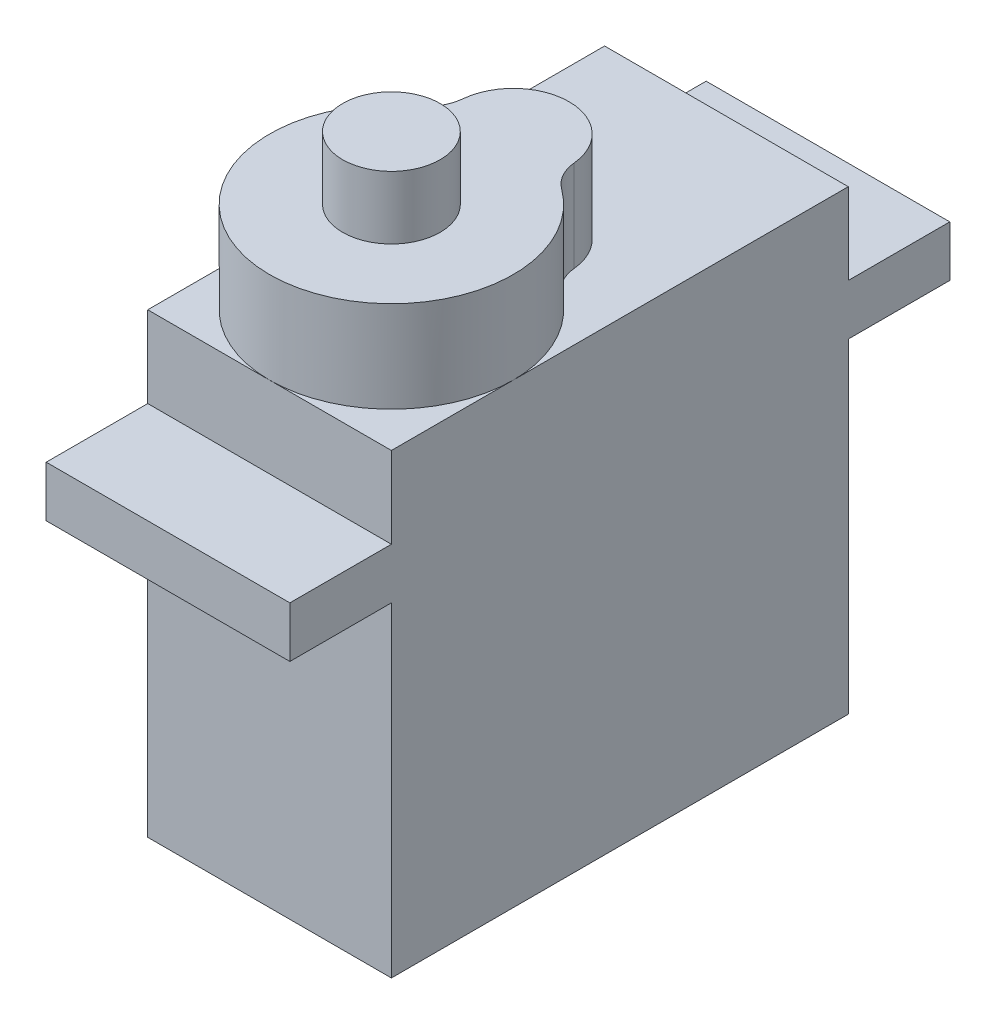
ISO-10303-21;
HEADER;
FILE_DESCRIPTION(('STEP AP214'),'2;1');
FILE_NAME('part.step','',(''),(''),'','','');
FILE_SCHEMA(('AUTOMOTIVE_DESIGN { 1 0 10303 214 1 1 1 1 }'));
ENDSEC;
DATA;
#1=APPLICATION_CONTEXT('core data for automotive mechanical design processes');
#2=APPLICATION_PROTOCOL_DEFINITION('international standard','automotive_design',2000,#1);
#3=PRODUCT_CONTEXT('',#1,'mechanical');
#4=PRODUCT('Part','Part','',(#3));
#5=PRODUCT_RELATED_PRODUCT_CATEGORY('part','',(#4));
#6=PRODUCT_DEFINITION_FORMATION('','',#4);
#7=PRODUCT_DEFINITION_CONTEXT('part definition',#1,'design');
#8=PRODUCT_DEFINITION('design','',#6,#7);
#9=PRODUCT_DEFINITION_SHAPE('','',#8);
#10=(LENGTH_UNIT() NAMED_UNIT(*) SI_UNIT(.MILLI.,.METRE.));
#11=(NAMED_UNIT(*) PLANE_ANGLE_UNIT() SI_UNIT($,.RADIAN.));
#12=(NAMED_UNIT(*) SI_UNIT($,.STERADIAN.) SOLID_ANGLE_UNIT());
#13=UNCERTAINTY_MEASURE_WITH_UNIT(LENGTH_MEASURE(1.E-05),#10,'distance_accuracy_value','');
#14=(GEOMETRIC_REPRESENTATION_CONTEXT(3) GLOBAL_UNCERTAINTY_ASSIGNED_CONTEXT((#13)) GLOBAL_UNIT_ASSIGNED_CONTEXT((#10,
#11,#12)) REPRESENTATION_CONTEXT('',''));
#15=CARTESIAN_POINT('',(0.,0.,0.));
#16=DIRECTION('',(0.,0.,1.));
#17=DIRECTION('',(1.,0.,0.));
#18=AXIS2_PLACEMENT_3D('',#15,#16,#17);
#19=CARTESIAN_POINT('',(0.,27.,5.25000000000001));
#20=DIRECTION('',(0.,-1.,0.));
#21=DIRECTION('',(0.,0.,-1.));
#22=AXIS2_PLACEMENT_3D('',#19,#20,#21);
#23=CYLINDRICAL_SURFACE('',#22,6.);
#24=CARTESIAN_POINT('',(0.,22.5,5.25000000000001));
#25=DIRECTION('',(0.,1.,0.));
#26=DIRECTION('',(0.,0.,1.));
#27=AXIS2_PLACEMENT_3D('',#24,#25,#26);
#28=CIRCLE('',#27,6.);
#29=CARTESIAN_POINT('',(6.,22.5,5.25000000000001));
#30=VERTEX_POINT('',#29);
#31=CARTESIAN_POINT('',(3.54625330110328,22.5,0.410156250000001));
#32=VERTEX_POINT('',#31);
#33=EDGE_CURVE('E184',#30,#32,#28,.T.);
#34=ORIENTED_EDGE('',*,*,#33,.T.);
#35=DIRECTION('',(0.,-1.,0.));
#36=VECTOR('',#35,1.);
#37=CARTESIAN_POINT('',(3.54625330110328,27.,0.410156250000001));
#38=LINE('',#37,#36);
#39=CARTESIAN_POINT('',(3.54625330110328,27.,0.410156250000001));
#40=VERTEX_POINT('',#39);
#41=EDGE_CURVE('E47',#32,#40,#38,.F.);
#42=ORIENTED_EDGE('',*,*,#41,.T.);
#43=CARTESIAN_POINT('',(0.,27.,5.25000000000001));
#44=DIRECTION('',(0.,1.,0.));
#45=DIRECTION('',(0.,0.,1.));
#46=AXIS2_PLACEMENT_3D('',#43,#44,#45);
#47=CIRCLE('',#46,6.);
#48=CARTESIAN_POINT('',(-3.54625330110328,27.,0.410156250000003));
#49=VERTEX_POINT('',#48);
#50=EDGE_CURVE('E178',#49,#40,#47,.T.);
#51=ORIENTED_EDGE('',*,*,#50,.F.);
#52=DIRECTION('',(0.,-1.,0.));
#53=VECTOR('',#52,1.);
#54=CARTESIAN_POINT('',(-3.54625330110328,27.,0.410156250000003));
#55=LINE('',#54,#53);
#56=CARTESIAN_POINT('',(-3.54625330110328,22.5,0.410156250000003));
#57=VERTEX_POINT('',#56);
#58=EDGE_CURVE('E286',#49,#57,#55,.T.);
#59=ORIENTED_EDGE('',*,*,#58,.T.);
#60=CARTESIAN_POINT('',(-6.,22.5,5.25000000000001));
#61=VERTEX_POINT('',#60);
#62=EDGE_CURVE('E181',#57,#61,#28,.T.);
#63=ORIENTED_EDGE('',*,*,#62,.T.);
#64=CARTESIAN_POINT('',(0.,22.5,11.25));
#65=VERTEX_POINT('',#64);
#66=EDGE_CURVE('E157',#61,#65,#28,.T.);
#67=ORIENTED_EDGE('',*,*,#66,.T.);
#68=EDGE_CURVE('E175',#65,#30,#28,.T.);
#69=ORIENTED_EDGE('',*,*,#68,.T.);
#70=EDGE_LOOP('',(#34,#42,#51,#59,#63,#67,#69));
#71=FACE_BOUND('',#70,.T.);
#72=ADVANCED_FACE('F32',(#71),#23,.T.);
#73=CARTESIAN_POINT('',(0.,22.5,0.));
#74=DIRECTION('',(0.,-1.,0.));
#75=DIRECTION('',(0.,0.,-1.));
#76=AXIS2_PLACEMENT_3D('',#73,#74,#75);
#77=PLANE('',#76);
#78=ORIENTED_EDGE('',*,*,#68,.F.);
#79=DIRECTION('',(1.,0.,0.));
#80=VECTOR('',#79,1.);
#81=CARTESIAN_POINT('',(6.,22.5,11.25));
#82=LINE('',#81,#80);
#83=CARTESIAN_POINT('',(6.,22.5,11.25));
#84=VERTEX_POINT('',#83);
#85=EDGE_CURVE('E163',#65,#84,#82,.T.);
#86=ORIENTED_EDGE('',*,*,#85,.T.);
#87=DIRECTION('',(0.,0.,-1.));
#88=VECTOR('',#87,1.);
#89=CARTESIAN_POINT('',(6.,22.5,-11.25));
#90=LINE('',#89,#88);
#91=EDGE_CURVE('E177',#84,#30,#90,.T.);
#92=ORIENTED_EDGE('',*,*,#91,.T.);
#93=EDGE_LOOP('',(#78,#86,#92));
#94=FACE_BOUND('',#93,.T.);
#95=ADVANCED_FACE('F176',(#94),#77,.F.);
#96=CARTESIAN_POINT('',(0.,22.5,-0.749999999999994));
#97=DIRECTION('',(0.,1.,0.));
#98=DIRECTION('',(0.,0.,1.));
#99=AXIS2_PLACEMENT_3D('',#96,#97,#98);
#100=CIRCLE('',#99,2.75);
#101=CARTESIAN_POINT('',(2.73745868857096,22.5,-1.01233552631579));
#102=VERTEX_POINT('',#101);
#103=CARTESIAN_POINT('',(-2.73745868857096,22.5,-1.01233552631579));
#104=VERTEX_POINT('',#103);
#105=EDGE_CURVE('E298',#102,#104,#100,.T.);
#106=ORIENTED_EDGE('',*,*,#105,.F.);
#107=CARTESIAN_POINT('',(4.72833773480438,22.5,-1.203125));
#108=DIRECTION('',(0.,-1.,0.));
#109=DIRECTION('',(0.,0.,-1.));
#110=AXIS2_PLACEMENT_3D('',#107,#108,#109);
#111=CIRCLE('',#110,2.);
#112=EDGE_CURVE('E284',#102,#32,#111,.F.);
#113=ORIENTED_EDGE('',*,*,#112,.T.);
#114=ORIENTED_EDGE('',*,*,#33,.F.);
#115=CARTESIAN_POINT('',(6.,22.5,-11.25));
#116=VERTEX_POINT('',#115);
#117=EDGE_CURVE('E162',#30,#116,#90,.T.);
#118=ORIENTED_EDGE('',*,*,#117,.T.);
#119=DIRECTION('',(-1.,0.,0.));
#120=VECTOR('',#119,1.);
#121=CARTESIAN_POINT('',(6.,22.5,-11.25));
#122=LINE('',#121,#120);
#123=CARTESIAN_POINT('',(-6.,22.5,-11.25));
#124=VERTEX_POINT('',#123);
#125=EDGE_CURVE('E258',#116,#124,#122,.T.);
#126=ORIENTED_EDGE('',*,*,#125,.T.);
#127=DIRECTION('',(0.,0.,1.));
#128=VECTOR('',#127,1.);
#129=CARTESIAN_POINT('',(-6.,22.5,-11.25));
#130=LINE('',#129,#128);
#131=EDGE_CURVE('E173',#124,#61,#130,.T.);
#132=ORIENTED_EDGE('',*,*,#131,.T.);
#133=ORIENTED_EDGE('',*,*,#62,.F.);
#134=CARTESIAN_POINT('',(-4.72833773480438,22.5,-1.203125));
#135=DIRECTION('',(0.,-1.,0.));
#136=DIRECTION('',(0.,0.,-1.));
#137=AXIS2_PLACEMENT_3D('',#134,#135,#136);
#138=CIRCLE('',#137,2.);
#139=EDGE_CURVE('E282',#57,#104,#138,.F.);
#140=ORIENTED_EDGE('',*,*,#139,.T.);
#141=EDGE_LOOP('',(#106,#113,#114,#118,#126,#132,#133,#140));
#142=FACE_BOUND('',#141,.T.);
#143=ADVANCED_FACE('F301',(#142),#77,.F.);
#144=CARTESIAN_POINT('',(6.,22.5,-11.25));
#145=DIRECTION('',(0.,0.,1.));
#146=DIRECTION('',(1.,0.,0.));
#147=AXIS2_PLACEMENT_3D('',#144,#145,#146);
#148=PLANE('',#147);
#149=DIRECTION('',(1.,0.,0.));
#150=VECTOR('',#149,1.);
#151=CARTESIAN_POINT('',(-11.5901699437495,18.5,-11.25));
#152=LINE('',#151,#150);
#153=CARTESIAN_POINT('',(-6.,18.5,-11.25));
#154=VERTEX_POINT('',#153);
#155=CARTESIAN_POINT('',(6.,18.5,-11.25));
#156=VERTEX_POINT('',#155);
#157=EDGE_CURVE('E217',#154,#156,#152,.T.);
#158=ORIENTED_EDGE('',*,*,#157,.F.);
#159=DIRECTION('',(0.,-1.,0.));
#160=VECTOR('',#159,1.);
#161=CARTESIAN_POINT('',(-6.,22.5,-11.25));
#162=LINE('',#161,#160);
#163=EDGE_CURVE('E272',#124,#154,#162,.T.);
#164=ORIENTED_EDGE('',*,*,#163,.F.);
#165=ORIENTED_EDGE('',*,*,#125,.F.);
#166=DIRECTION('',(0.,-1.,0.));
#167=VECTOR('',#166,1.);
#168=CARTESIAN_POINT('',(6.,22.5,-11.25));
#169=LINE('',#168,#167);
#170=EDGE_CURVE('E276',#116,#156,#169,.T.);
#171=ORIENTED_EDGE('',*,*,#170,.T.);
#172=EDGE_LOOP('',(#158,#164,#165,#171));
#173=FACE_BOUND('',#172,.T.);
#174=ADVANCED_FACE('F354',(#173),#148,.F.);
#175=CARTESIAN_POINT('',(6.,22.5,11.25));
#176=DIRECTION('',(0.,0.,-1.));
#177=DIRECTION('',(-1.,0.,0.));
#178=AXIS2_PLACEMENT_3D('',#175,#176,#177);
#179=PLANE('',#178);
#180=DIRECTION('',(1.,0.,0.));
#181=VECTOR('',#180,1.);
#182=CARTESIAN_POINT('',(-11.5901699437495,16.,11.25));
#183=LINE('',#182,#181);
#184=CARTESIAN_POINT('',(-6.,16.,11.25));
#185=VERTEX_POINT('',#184);
#186=CARTESIAN_POINT('',(6.,16.,11.25));
#187=VERTEX_POINT('',#186);
#188=EDGE_CURVE('E233',#185,#187,#183,.T.);
#189=ORIENTED_EDGE('',*,*,#188,.F.);
#190=DIRECTION('',(0.,-1.,0.));
#191=VECTOR('',#190,1.);
#192=CARTESIAN_POINT('',(-6.,22.5,11.25));
#193=LINE('',#192,#191);
#194=CARTESIAN_POINT('',(-6.,0.,11.25));
#195=VERTEX_POINT('',#194);
#196=EDGE_CURVE('E185',#185,#195,#193,.T.);
#197=ORIENTED_EDGE('',*,*,#196,.T.);
#198=DIRECTION('',(1.,0.,0.));
#199=VECTOR('',#198,1.);
#200=CARTESIAN_POINT('',(6.,0.,11.25));
#201=LINE('',#200,#199);
#202=CARTESIAN_POINT('',(6.,0.,11.25));
#203=VERTEX_POINT('',#202);
#204=EDGE_CURVE('E263',#195,#203,#201,.T.);
#205=ORIENTED_EDGE('',*,*,#204,.T.);
#206=DIRECTION('',(0.,-1.,0.));
#207=VECTOR('',#206,1.);
#208=CARTESIAN_POINT('',(6.,22.5,11.25));
#209=LINE('',#208,#207);
#210=EDGE_CURVE('E278',#187,#203,#209,.T.);
#211=ORIENTED_EDGE('',*,*,#210,.F.);
#212=EDGE_LOOP('',(#189,#197,#205,#211));
#213=FACE_BOUND('',#212,.T.);
#214=ADVANCED_FACE('F331',(#213),#179,.F.);
#215=CARTESIAN_POINT('',(-6.,22.5,-11.25));
#216=DIRECTION('',(1.,0.,0.));
#217=DIRECTION('',(0.,0.,-1.));
#218=AXIS2_PLACEMENT_3D('',#215,#216,#217);
#219=PLANE('',#218);
#220=DIRECTION('',(0.,0.,1.));
#221=VECTOR('',#220,1.);
#222=CARTESIAN_POINT('',(-6.,0.,-11.25));
#223=LINE('',#222,#221);
#224=CARTESIAN_POINT('',(-6.,0.,-11.25));
#225=VERTEX_POINT('',#224);
#226=EDGE_CURVE('E254',#225,#195,#223,.T.);
#227=ORIENTED_EDGE('',*,*,#226,.T.);
#228=ORIENTED_EDGE('',*,*,#196,.F.);
#229=DIRECTION('',(0.,0.,1.));
#230=VECTOR('',#229,1.);
#231=CARTESIAN_POINT('',(-6.,16.,11.25));
#232=LINE('',#231,#230);
#233=CARTESIAN_POINT('',(-6.,16.,16.25));
#234=VERTEX_POINT('',#233);
#235=EDGE_CURVE('E232',#185,#234,#232,.T.);
#236=ORIENTED_EDGE('',*,*,#235,.T.);
#237=DIRECTION('',(0.,1.,0.));
#238=VECTOR('',#237,1.);
#239=CARTESIAN_POINT('',(-6.,18.5,16.25));
#240=LINE('',#239,#238);
#241=CARTESIAN_POINT('',(-6.,18.5,16.25));
#242=VERTEX_POINT('',#241);
#243=EDGE_CURVE('E230',#234,#242,#240,.T.);
#244=ORIENTED_EDGE('',*,*,#243,.T.);
#245=DIRECTION('',(0.,0.,-1.));
#246=VECTOR('',#245,1.);
#247=CARTESIAN_POINT('',(-6.,18.5,11.25));
#248=LINE('',#247,#246);
#249=CARTESIAN_POINT('',(-6.,18.5,11.25));
#250=VERTEX_POINT('',#249);
#251=EDGE_CURVE('E235',#242,#250,#248,.T.);
#252=ORIENTED_EDGE('',*,*,#251,.T.);
#253=CARTESIAN_POINT('',(-6.,22.5,11.25));
#254=VERTEX_POINT('',#253);
#255=EDGE_CURVE('E183',#254,#250,#193,.T.);
#256=ORIENTED_EDGE('',*,*,#255,.F.);
#257=EDGE_CURVE('E159',#61,#254,#130,.T.);
#258=ORIENTED_EDGE('',*,*,#257,.F.);
#259=ORIENTED_EDGE('',*,*,#131,.F.);
#260=ORIENTED_EDGE('',*,*,#163,.T.);
#261=DIRECTION('',(0.,0.,-1.));
#262=VECTOR('',#261,1.);
#263=CARTESIAN_POINT('',(-6.,18.5,-11.25));
#264=LINE('',#263,#262);
#265=CARTESIAN_POINT('',(-6.,18.5,-16.25));
#266=VERTEX_POINT('',#265);
#267=EDGE_CURVE('E212',#154,#266,#264,.T.);
#268=ORIENTED_EDGE('',*,*,#267,.T.);
#269=DIRECTION('',(0.,-1.,0.));
#270=VECTOR('',#269,1.);
#271=CARTESIAN_POINT('',(-6.,18.5,-16.25));
#272=LINE('',#271,#270);
#273=CARTESIAN_POINT('',(-6.,16.,-16.25));
#274=VERTEX_POINT('',#273);
#275=EDGE_CURVE('E220',#266,#274,#272,.T.);
#276=ORIENTED_EDGE('',*,*,#275,.T.);
#277=DIRECTION('',(0.,0.,1.));
#278=VECTOR('',#277,1.);
#279=CARTESIAN_POINT('',(-6.,16.,-11.25));
#280=LINE('',#279,#278);
#281=CARTESIAN_POINT('',(-6.,16.,-11.25));
#282=VERTEX_POINT('',#281);
#283=EDGE_CURVE('E226',#274,#282,#280,.T.);
#284=ORIENTED_EDGE('',*,*,#283,.T.);
#285=EDGE_CURVE('E260',#282,#225,#162,.T.);
#286=ORIENTED_EDGE('',*,*,#285,.T.);
#287=EDGE_LOOP('',(#227,#228,#236,#244,#252,#256,#258,#259,#260,#268,#276,#284,#286));
#288=FACE_BOUND('',#287,.T.);
#289=ADVANCED_FACE('F311',(#288),#219,.F.);
#290=ORIENTED_EDGE('',*,*,#255,.T.);
#291=DIRECTION('',(1.,0.,0.));
#292=VECTOR('',#291,1.);
#293=CARTESIAN_POINT('',(-11.5901699437495,18.5,11.25));
#294=LINE('',#293,#292);
#295=CARTESIAN_POINT('',(6.,18.5,11.25));
#296=VERTEX_POINT('',#295);
#297=EDGE_CURVE('E244',#250,#296,#294,.T.);
#298=ORIENTED_EDGE('',*,*,#297,.T.);
#299=EDGE_CURVE('E169',#84,#296,#209,.T.);
#300=ORIENTED_EDGE('',*,*,#299,.F.);
#301=ORIENTED_EDGE('',*,*,#85,.F.);
#302=EDGE_CURVE('E153',#254,#65,#82,.T.);
#303=ORIENTED_EDGE('',*,*,#302,.F.);
#304=EDGE_LOOP('',(#290,#298,#300,#301,#303));
#305=FACE_BOUND('',#304,.T.);
#306=ADVANCED_FACE('F167',(#305),#179,.F.);
#307=CARTESIAN_POINT('',(6.,22.5,-11.25));
#308=DIRECTION('',(-1.,0.,0.));
#309=DIRECTION('',(0.,0.,1.));
#310=AXIS2_PLACEMENT_3D('',#307,#308,#309);
#311=PLANE('',#310);
#312=DIRECTION('',(0.,0.,-1.));
#313=VECTOR('',#312,1.);
#314=CARTESIAN_POINT('',(6.,0.,-11.25));
#315=LINE('',#314,#313);
#316=CARTESIAN_POINT('',(6.,0.,-11.25));
#317=VERTEX_POINT('',#316);
#318=EDGE_CURVE('E266',#203,#317,#315,.T.);
#319=ORIENTED_EDGE('',*,*,#318,.T.);
#320=CARTESIAN_POINT('',(6.,16.,-11.25));
#321=VERTEX_POINT('',#320);
#322=EDGE_CURVE('E275',#321,#317,#169,.T.);
#323=ORIENTED_EDGE('',*,*,#322,.F.);
#324=DIRECTION('',(0.,0.,-1.));
#325=VECTOR('',#324,1.);
#326=CARTESIAN_POINT('',(6.,16.,-11.25));
#327=LINE('',#326,#325);
#328=CARTESIAN_POINT('',(6.,16.,-16.25));
#329=VERTEX_POINT('',#328);
#330=EDGE_CURVE('E200',#321,#329,#327,.T.);
#331=ORIENTED_EDGE('',*,*,#330,.T.);
#332=DIRECTION('',(0.,1.,0.));
#333=VECTOR('',#332,1.);
#334=CARTESIAN_POINT('',(6.,18.5,-16.25));
#335=LINE('',#334,#333);
#336=CARTESIAN_POINT('',(6.,18.5,-16.25));
#337=VERTEX_POINT('',#336);
#338=EDGE_CURVE('E203',#329,#337,#335,.T.);
#339=ORIENTED_EDGE('',*,*,#338,.T.);
#340=DIRECTION('',(0.,0.,1.));
#341=VECTOR('',#340,1.);
#342=CARTESIAN_POINT('',(6.,18.5,-11.25));
#343=LINE('',#342,#341);
#344=EDGE_CURVE('E209',#337,#156,#343,.T.);
#345=ORIENTED_EDGE('',*,*,#344,.T.);
#346=ORIENTED_EDGE('',*,*,#170,.F.);
#347=ORIENTED_EDGE('',*,*,#117,.F.);
#348=ORIENTED_EDGE('',*,*,#91,.F.);
#349=ORIENTED_EDGE('',*,*,#299,.T.);
#350=DIRECTION('',(0.,0.,1.));
#351=VECTOR('',#350,1.);
#352=CARTESIAN_POINT('',(6.,18.5,11.25));
#353=LINE('',#352,#351);
#354=CARTESIAN_POINT('',(6.,18.5,16.25));
#355=VERTEX_POINT('',#354);
#356=EDGE_CURVE('E229',#296,#355,#353,.T.);
#357=ORIENTED_EDGE('',*,*,#356,.T.);
#358=DIRECTION('',(0.,-1.,0.));
#359=VECTOR('',#358,1.);
#360=CARTESIAN_POINT('',(6.,18.5,16.25));
#361=LINE('',#360,#359);
#362=CARTESIAN_POINT('',(6.,16.,16.25));
#363=VERTEX_POINT('',#362);
#364=EDGE_CURVE('E238',#355,#363,#361,.T.);
#365=ORIENTED_EDGE('',*,*,#364,.T.);
#366=DIRECTION('',(0.,0.,-1.));
#367=VECTOR('',#366,1.);
#368=CARTESIAN_POINT('',(6.,16.,11.25));
#369=LINE('',#368,#367);
#370=EDGE_CURVE('E241',#363,#187,#369,.T.);
#371=ORIENTED_EDGE('',*,*,#370,.T.);
#372=ORIENTED_EDGE('',*,*,#210,.T.);
#373=EDGE_LOOP('',(#319,#323,#331,#339,#345,#346,#347,#348,#349,#357,#365,#371,#372));
#374=FACE_BOUND('',#373,.T.);
#375=ADVANCED_FACE('F317',(#374),#311,.F.);
#376=ORIENTED_EDGE('',*,*,#285,.F.);
#377=DIRECTION('',(1.,0.,0.));
#378=VECTOR('',#377,1.);
#379=CARTESIAN_POINT('',(-11.5901699437495,16.,-11.25));
#380=LINE('',#379,#378);
#381=EDGE_CURVE('E216',#282,#321,#380,.T.);
#382=ORIENTED_EDGE('',*,*,#381,.T.);
#383=ORIENTED_EDGE('',*,*,#322,.T.);
#384=DIRECTION('',(-1.,0.,0.));
#385=VECTOR('',#384,1.);
#386=CARTESIAN_POINT('',(6.,0.,-11.25));
#387=LINE('',#386,#385);
#388=EDGE_CURVE('E269',#317,#225,#387,.T.);
#389=ORIENTED_EDGE('',*,*,#388,.T.);
#390=EDGE_LOOP('',(#376,#382,#383,#389));
#391=FACE_BOUND('',#390,.T.);
#392=ADVANCED_FACE('F357',(#391),#148,.F.);
#393=ORIENTED_EDGE('',*,*,#66,.F.);
#394=ORIENTED_EDGE('',*,*,#257,.T.);
#395=ORIENTED_EDGE('',*,*,#302,.T.);
#396=EDGE_LOOP('',(#393,#394,#395));
#397=FACE_BOUND('',#396,.T.);
#398=ADVANCED_FACE('F155',(#397),#77,.F.);
#399=CARTESIAN_POINT('',(0.,0.,0.));
#400=DIRECTION('',(0.,-1.,0.));
#401=DIRECTION('',(0.,0.,-1.));
#402=AXIS2_PLACEMENT_3D('',#399,#400,#401);
#403=PLANE('',#402);
#404=ORIENTED_EDGE('',*,*,#226,.F.);
#405=ORIENTED_EDGE('',*,*,#388,.F.);
#406=ORIENTED_EDGE('',*,*,#318,.F.);
#407=ORIENTED_EDGE('',*,*,#204,.F.);
#408=EDGE_LOOP('',(#404,#405,#406,#407));
#409=FACE_BOUND('',#408,.T.);
#410=ADVANCED_FACE('F336',(#409),#403,.T.);
#411=CARTESIAN_POINT('',(-11.5901699437495,16.,11.25));
#412=DIRECTION('',(0.,-1.,0.));
#413=DIRECTION('',(0.,0.,-1.));
#414=AXIS2_PLACEMENT_3D('',#411,#412,#413);
#415=PLANE('',#414);
#416=ORIENTED_EDGE('',*,*,#235,.F.);
#417=ORIENTED_EDGE('',*,*,#188,.T.);
#418=ORIENTED_EDGE('',*,*,#370,.F.);
#419=DIRECTION('',(1.,0.,0.));
#420=VECTOR('',#419,1.);
#421=CARTESIAN_POINT('',(-11.5901699437495,16.,16.25));
#422=LINE('',#421,#420);
#423=EDGE_CURVE('E247',#234,#363,#422,.T.);
#424=ORIENTED_EDGE('',*,*,#423,.F.);
#425=EDGE_LOOP('',(#416,#417,#418,#424));
#426=FACE_BOUND('',#425,.T.);
#427=ADVANCED_FACE('F328',(#426),#415,.T.);
#428=CARTESIAN_POINT('',(-11.5901699437495,18.5,16.25));
#429=DIRECTION('',(0.,0.,1.));
#430=DIRECTION('',(1.,0.,0.));
#431=AXIS2_PLACEMENT_3D('',#428,#429,#430);
#432=PLANE('',#431);
#433=ORIENTED_EDGE('',*,*,#243,.F.);
#434=ORIENTED_EDGE('',*,*,#423,.T.);
#435=ORIENTED_EDGE('',*,*,#364,.F.);
#436=DIRECTION('',(1.,0.,0.));
#437=VECTOR('',#436,1.);
#438=CARTESIAN_POINT('',(-11.5901699437495,18.5,16.25));
#439=LINE('',#438,#437);
#440=EDGE_CURVE('E249',#242,#355,#439,.T.);
#441=ORIENTED_EDGE('',*,*,#440,.F.);
#442=EDGE_LOOP('',(#433,#434,#435,#441));
#443=FACE_BOUND('',#442,.T.);
#444=ADVANCED_FACE('F323',(#443),#432,.T.);
#445=CARTESIAN_POINT('',(-11.5901699437495,18.5,11.25));
#446=DIRECTION('',(0.,1.,0.));
#447=DIRECTION('',(0.,0.,1.));
#448=AXIS2_PLACEMENT_3D('',#445,#446,#447);
#449=PLANE('',#448);
#450=ORIENTED_EDGE('',*,*,#251,.F.);
#451=ORIENTED_EDGE('',*,*,#440,.T.);
#452=ORIENTED_EDGE('',*,*,#356,.F.);
#453=ORIENTED_EDGE('',*,*,#297,.F.);
#454=EDGE_LOOP('',(#450,#451,#452,#453));
#455=FACE_BOUND('',#454,.T.);
#456=ADVANCED_FACE('F318',(#455),#449,.T.);
#457=CARTESIAN_POINT('',(-11.5901699437495,18.5,-11.25));
#458=DIRECTION('',(0.,1.,0.));
#459=DIRECTION('',(0.,0.,1.));
#460=AXIS2_PLACEMENT_3D('',#457,#458,#459);
#461=PLANE('',#460);
#462=ORIENTED_EDGE('',*,*,#267,.F.);
#463=ORIENTED_EDGE('',*,*,#157,.T.);
#464=ORIENTED_EDGE('',*,*,#344,.F.);
#465=DIRECTION('',(1.,0.,0.));
#466=VECTOR('',#465,1.);
#467=CARTESIAN_POINT('',(-11.5901699437495,18.5,-16.25));
#468=LINE('',#467,#466);
#469=EDGE_CURVE('E221',#266,#337,#468,.T.);
#470=ORIENTED_EDGE('',*,*,#469,.F.);
#471=EDGE_LOOP('',(#462,#463,#464,#470));
#472=FACE_BOUND('',#471,.T.);
#473=ADVANCED_FACE('F352',(#472),#461,.T.);
#474=CARTESIAN_POINT('',(-11.5901699437495,18.5,-16.25));
#475=DIRECTION('',(0.,0.,-1.));
#476=DIRECTION('',(-1.,0.,0.));
#477=AXIS2_PLACEMENT_3D('',#474,#475,#476);
#478=PLANE('',#477);
#479=ORIENTED_EDGE('',*,*,#275,.F.);
#480=ORIENTED_EDGE('',*,*,#469,.T.);
#481=ORIENTED_EDGE('',*,*,#338,.F.);
#482=DIRECTION('',(1.,0.,0.));
#483=VECTOR('',#482,1.);
#484=CARTESIAN_POINT('',(-11.5901699437495,16.,-16.25));
#485=LINE('',#484,#483);
#486=EDGE_CURVE('E223',#274,#329,#485,.T.);
#487=ORIENTED_EDGE('',*,*,#486,.F.);
#488=EDGE_LOOP('',(#479,#480,#481,#487));
#489=FACE_BOUND('',#488,.T.);
#490=ADVANCED_FACE('F347',(#489),#478,.T.);
#491=CARTESIAN_POINT('',(-11.5901699437495,16.,-11.25));
#492=DIRECTION('',(0.,-1.,0.));
#493=DIRECTION('',(0.,0.,-1.));
#494=AXIS2_PLACEMENT_3D('',#491,#492,#493);
#495=PLANE('',#494);
#496=ORIENTED_EDGE('',*,*,#283,.F.);
#497=ORIENTED_EDGE('',*,*,#486,.T.);
#498=ORIENTED_EDGE('',*,*,#330,.F.);
#499=ORIENTED_EDGE('',*,*,#381,.F.);
#500=EDGE_LOOP('',(#496,#497,#498,#499));
#501=FACE_BOUND('',#500,.T.);
#502=ADVANCED_FACE('F342',(#501),#495,.T.);
#503=CARTESIAN_POINT('',(0.,27.,5.25000000000001));
#504=DIRECTION('',(0.,1.,0.));
#505=DIRECTION('',(0.,0.,1.));
#506=AXIS2_PLACEMENT_3D('',#503,#504,#505);
#507=PLANE('',#506);
#508=CARTESIAN_POINT('',(0.,27.,5.25000000000001));
#509=DIRECTION('',(0.,1.,0.));
#510=DIRECTION('',(0.,0.,1.));
#511=AXIS2_PLACEMENT_3D('',#508,#509,#510);
#512=CIRCLE('',#511,2.4);
#513=CARTESIAN_POINT('',(0.,27.,7.65000000000001));
#514=VERTEX_POINT('',#513);
#515=EDGE_CURVE('E189',#514,#514,#512,.T.);
#516=ORIENTED_EDGE('',*,*,#515,.F.);
#517=EDGE_LOOP('',(#516));
#518=FACE_BOUND('',#517,.T.);
#519=CARTESIAN_POINT('',(0.,27.,-0.749999999999994));
#520=DIRECTION('',(0.,1.,0.));
#521=DIRECTION('',(0.,0.,1.));
#522=AXIS2_PLACEMENT_3D('',#519,#520,#521);
#523=CIRCLE('',#522,2.75);
#524=CARTESIAN_POINT('',(2.73745868857096,27.,-1.01233552631579));
#525=VERTEX_POINT('',#524);
#526=CARTESIAN_POINT('',(-2.73745868857096,27.,-1.01233552631579));
#527=VERTEX_POINT('',#526);
#528=EDGE_CURVE('E290',#525,#527,#523,.T.);
#529=ORIENTED_EDGE('',*,*,#528,.T.);
#530=CARTESIAN_POINT('',(-4.72833773480438,27.,-1.203125));
#531=DIRECTION('',(0.,1.,0.));
#532=DIRECTION('',(0.,0.,1.));
#533=AXIS2_PLACEMENT_3D('',#530,#531,#532);
#534=CIRCLE('',#533,2.);
#535=EDGE_CURVE('E11',#527,#49,#534,.F.);
#536=ORIENTED_EDGE('',*,*,#535,.T.);
#537=ORIENTED_EDGE('',*,*,#50,.T.);
#538=CARTESIAN_POINT('',(4.72833773480438,27.,-1.203125));
#539=DIRECTION('',(0.,1.,0.));
#540=DIRECTION('',(0.,0.,1.));
#541=AXIS2_PLACEMENT_3D('',#538,#539,#540);
#542=CIRCLE('',#541,2.);
#543=EDGE_CURVE('E40',#40,#525,#542,.F.);
#544=ORIENTED_EDGE('',*,*,#543,.T.);
#545=EDGE_LOOP('',(#529,#536,#537,#544));
#546=FACE_BOUND('',#545,.T.);
#547=ADVANCED_FACE('F289',(#518,#546),#507,.T.);
#548=CARTESIAN_POINT('',(0.,30.1,5.25000000000001));
#549=DIRECTION('',(0.,-1.,0.));
#550=DIRECTION('',(0.,0.,-1.));
#551=AXIS2_PLACEMENT_3D('',#548,#549,#550);
#552=CYLINDRICAL_SURFACE('',#551,2.4);
#553=CARTESIAN_POINT('',(0.,30.1,5.25000000000001));
#554=DIRECTION('',(0.,1.,0.));
#555=DIRECTION('',(0.,0.,1.));
#556=AXIS2_PLACEMENT_3D('',#553,#554,#555);
#557=CIRCLE('',#556,2.4);
#558=CARTESIAN_POINT('',(0.,30.1,7.65000000000001));
#559=VERTEX_POINT('',#558);
#560=EDGE_CURVE('E179',#559,#559,#557,.T.);
#561=ORIENTED_EDGE('',*,*,#560,.F.);
#562=EDGE_LOOP('',(#561));
#563=FACE_BOUND('',#562,.T.);
#564=ORIENTED_EDGE('',*,*,#515,.T.);
#565=EDGE_LOOP('',(#564));
#566=FACE_BOUND('',#565,.T.);
#567=ADVANCED_FACE('F424',(#563,#566),#552,.T.);
#568=CARTESIAN_POINT('',(0.,30.1,5.25000000000001));
#569=DIRECTION('',(0.,1.,0.));
#570=DIRECTION('',(0.,0.,1.));
#571=AXIS2_PLACEMENT_3D('',#568,#569,#570);
#572=PLANE('',#571);
#573=ORIENTED_EDGE('',*,*,#560,.T.);
#574=EDGE_LOOP('',(#573));
#575=FACE_BOUND('',#574,.T.);
#576=ADVANCED_FACE('F433',(#575),#572,.T.);
#577=CARTESIAN_POINT('',(0.,34.778174593052,-0.749999999999994));
#578=DIRECTION('',(0.,-1.,0.));
#579=DIRECTION('',(0.,0.,-1.));
#580=AXIS2_PLACEMENT_3D('',#577,#578,#579);
#581=CYLINDRICAL_SURFACE('',#580,2.75);
#582=ORIENTED_EDGE('',*,*,#528,.F.);
#583=DIRECTION('',(0.,-1.,0.));
#584=VECTOR('',#583,1.);
#585=CARTESIAN_POINT('',(2.73745868857096,34.778174593052,-1.01233552631579));
#586=LINE('',#585,#584);
#587=EDGE_CURVE('E196',#525,#102,#586,.T.);
#588=ORIENTED_EDGE('',*,*,#587,.T.);
#589=ORIENTED_EDGE('',*,*,#105,.T.);
#590=DIRECTION('',(0.,-1.,0.));
#591=VECTOR('',#590,1.);
#592=CARTESIAN_POINT('',(-2.73745868857096,34.778174593052,-1.01233552631579));
#593=LINE('',#592,#591);
#594=EDGE_CURVE('E191',#104,#527,#593,.F.);
#595=ORIENTED_EDGE('',*,*,#594,.T.);
#596=EDGE_LOOP('',(#582,#588,#589,#595));
#597=FACE_BOUND('',#596,.T.);
#598=ADVANCED_FACE('F294',(#597),#581,.T.);
#599=CARTESIAN_POINT('',(4.72833773480438,27.,-1.203125));
#600=DIRECTION('',(0.,1.,0.));
#601=DIRECTION('',(0.,0.,1.));
#602=AXIS2_PLACEMENT_3D('',#599,#600,#601);
#603=CYLINDRICAL_SURFACE('',#602,2.);
#604=ORIENTED_EDGE('',*,*,#543,.F.);
#605=ORIENTED_EDGE('',*,*,#41,.F.);
#606=ORIENTED_EDGE('',*,*,#112,.F.);
#607=ORIENTED_EDGE('',*,*,#587,.F.);
#608=EDGE_LOOP('',(#604,#605,#606,#607));
#609=FACE_BOUND('',#608,.T.);
#610=ADVANCED_FACE('F299',(#609),#603,.F.);
#611=CARTESIAN_POINT('',(-4.72833773480438,27.,-1.203125));
#612=DIRECTION('',(0.,-1.,0.));
#613=DIRECTION('',(0.,0.,-1.));
#614=AXIS2_PLACEMENT_3D('',#611,#612,#613);
#615=CYLINDRICAL_SURFACE('',#614,2.);
#616=ORIENTED_EDGE('',*,*,#139,.F.);
#617=ORIENTED_EDGE('',*,*,#58,.F.);
#618=ORIENTED_EDGE('',*,*,#535,.F.);
#619=ORIENTED_EDGE('',*,*,#594,.F.);
#620=EDGE_LOOP('',(#616,#617,#618,#619));
#621=FACE_BOUND('',#620,.T.);
#622=ADVANCED_FACE('F34',(#621),#615,.F.);
#623=CLOSED_SHELL('',(#72,#95,#143,#174,#214,#289,#306,#375,#392,#398,#410,#427,#444,#456,#473,
#490,#502,#547,#567,#576,#598,#610,#622));
#624=MANIFOLD_SOLID_BREP('B2',#623);
#625=ADVANCED_BREP_SHAPE_REPRESENTATION('',(#18,#624),#14);
#626=SHAPE_DEFINITION_REPRESENTATION(#9,#625);
ENDSEC;
END-ISO-10303-21;
